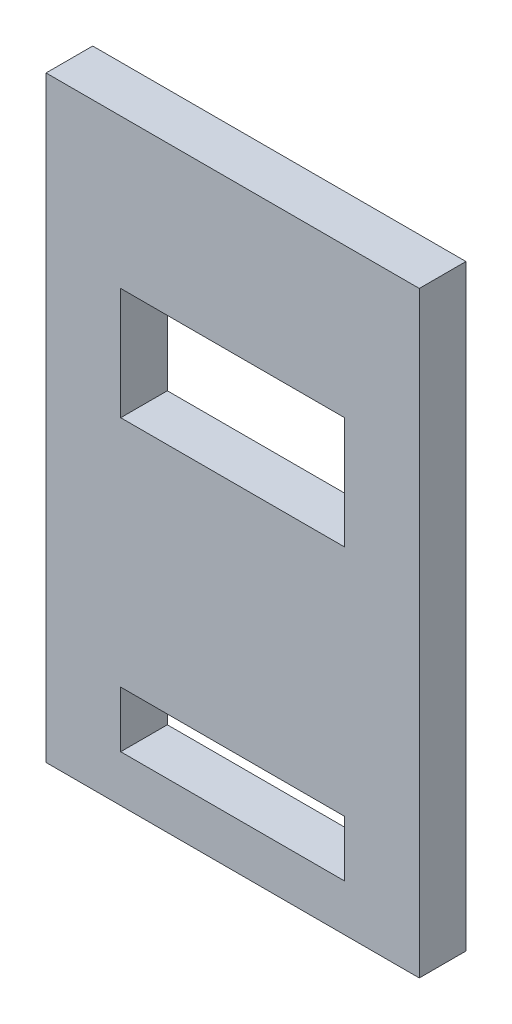
ISO-10303-21;
HEADER;
FILE_DESCRIPTION(('STEP AP214'),'2;1');
FILE_NAME('part.step','',(''),(''),'','','');
FILE_SCHEMA(('AUTOMOTIVE_DESIGN { 1 0 10303 214 1 1 1 1 }'));
ENDSEC;
DATA;
#1=APPLICATION_CONTEXT('core data for automotive mechanical design processes');
#2=APPLICATION_PROTOCOL_DEFINITION('international standard','automotive_design',2000,#1);
#3=PRODUCT_CONTEXT('',#1,'mechanical');
#4=PRODUCT('Part','Part','',(#3));
#5=PRODUCT_RELATED_PRODUCT_CATEGORY('part','',(#4));
#6=PRODUCT_DEFINITION_FORMATION('','',#4);
#7=PRODUCT_DEFINITION_CONTEXT('part definition',#1,'design');
#8=PRODUCT_DEFINITION('design','',#6,#7);
#9=PRODUCT_DEFINITION_SHAPE('','',#8);
#10=(LENGTH_UNIT() NAMED_UNIT(*) SI_UNIT(.MILLI.,.METRE.));
#11=(NAMED_UNIT(*) PLANE_ANGLE_UNIT() SI_UNIT($,.RADIAN.));
#12=(NAMED_UNIT(*) SI_UNIT($,.STERADIAN.) SOLID_ANGLE_UNIT());
#13=UNCERTAINTY_MEASURE_WITH_UNIT(LENGTH_MEASURE(1.E-05),#10,'distance_accuracy_value','');
#14=(GEOMETRIC_REPRESENTATION_CONTEXT(3) GLOBAL_UNCERTAINTY_ASSIGNED_CONTEXT((#13)) GLOBAL_UNIT_ASSIGNED_CONTEXT((#10,
#11,#12)) REPRESENTATION_CONTEXT('',''));
#15=CARTESIAN_POINT('',(0.,0.,0.));
#16=DIRECTION('',(0.,0.,1.));
#17=DIRECTION('',(1.,0.,0.));
#18=AXIS2_PLACEMENT_3D('',#15,#16,#17);
#19=CARTESIAN_POINT('',(-42.7885304659498,106.01541218638,15.875));
#20=DIRECTION('',(1.,0.,0.));
#21=DIRECTION('',(0.,1.,0.));
#22=AXIS2_PLACEMENT_3D('',#19,#20,#21);
#23=PLANE('',#22);
#24=DIRECTION('',(0.,-1.,0.));
#25=VECTOR('',#24,1.);
#26=CARTESIAN_POINT('',(-42.7885304659498,106.01541218638,0.));
#27=LINE('',#26,#25);
#28=CARTESIAN_POINT('',(-42.7885304659498,106.01541218638,0.));
#29=VERTEX_POINT('',#28);
#30=CARTESIAN_POINT('',(-42.7885304659498,-97.1845878136201,0.));
#31=VERTEX_POINT('',#30);
#32=EDGE_CURVE('E183',#29,#31,#27,.T.);
#33=ORIENTED_EDGE('',*,*,#32,.T.);
#34=DIRECTION('',(0.,0.,-1.));
#35=VECTOR('',#34,1.);
#36=CARTESIAN_POINT('',(-42.7885304659498,-97.1845878136201,15.875));
#37=LINE('',#36,#35);
#38=CARTESIAN_POINT('',(-42.7885304659498,-97.1845878136201,15.875));
#39=VERTEX_POINT('',#38);
#40=EDGE_CURVE('E11',#39,#31,#37,.T.);
#41=ORIENTED_EDGE('',*,*,#40,.F.);
#42=DIRECTION('',(0.,-1.,0.));
#43=VECTOR('',#42,1.);
#44=CARTESIAN_POINT('',(-42.7885304659498,106.01541218638,15.875));
#45=LINE('',#44,#43);
#46=CARTESIAN_POINT('',(-42.7885304659498,106.01541218638,15.875));
#47=VERTEX_POINT('',#46);
#48=EDGE_CURVE('E190',#47,#39,#45,.T.);
#49=ORIENTED_EDGE('',*,*,#48,.F.);
#50=DIRECTION('',(0.,0.,-1.));
#51=VECTOR('',#50,1.);
#52=CARTESIAN_POINT('',(-42.7885304659498,106.01541218638,15.875));
#53=LINE('',#52,#51);
#54=EDGE_CURVE('E200',#47,#29,#53,.T.);
#55=ORIENTED_EDGE('',*,*,#54,.T.);
#56=EDGE_LOOP('',(#33,#41,#49,#55));
#57=FACE_BOUND('',#56,.T.);
#58=ADVANCED_FACE('F33',(#57),#23,.F.);
#59=CARTESIAN_POINT('',(-42.7885304659498,-97.1845878136201,15.875));
#60=DIRECTION('',(0.,1.,0.));
#61=DIRECTION('',(0.,0.,1.));
#62=AXIS2_PLACEMENT_3D('',#59,#60,#61);
#63=PLANE('',#62);
#64=DIRECTION('',(1.,0.,0.));
#65=VECTOR('',#64,1.);
#66=CARTESIAN_POINT('',(-42.7885304659498,-97.1845878136201,0.));
#67=LINE('',#66,#65);
#68=CARTESIAN_POINT('',(84.2114695340502,-97.1845878136201,0.));
#69=VERTEX_POINT('',#68);
#70=EDGE_CURVE('E203',#31,#69,#67,.T.);
#71=ORIENTED_EDGE('',*,*,#70,.T.);
#72=DIRECTION('',(0.,0.,-1.));
#73=VECTOR('',#72,1.);
#74=CARTESIAN_POINT('',(84.2114695340502,-97.1845878136201,15.875));
#75=LINE('',#74,#73);
#76=CARTESIAN_POINT('',(84.2114695340502,-97.1845878136201,15.875));
#77=VERTEX_POINT('',#76);
#78=EDGE_CURVE('E40',#77,#69,#75,.T.);
#79=ORIENTED_EDGE('',*,*,#78,.F.);
#80=DIRECTION('',(1.,0.,0.));
#81=VECTOR('',#80,1.);
#82=CARTESIAN_POINT('',(-42.7885304659498,-97.1845878136201,15.875));
#83=LINE('',#82,#81);
#84=EDGE_CURVE('E193',#39,#77,#83,.T.);
#85=ORIENTED_EDGE('',*,*,#84,.F.);
#86=ORIENTED_EDGE('',*,*,#40,.T.);
#87=EDGE_LOOP('',(#71,#79,#85,#86));
#88=FACE_BOUND('',#87,.T.);
#89=ADVANCED_FACE('F232',(#88),#63,.F.);
#90=CARTESIAN_POINT('',(84.2114695340502,106.01541218638,15.875));
#91=DIRECTION('',(-1.,0.,0.));
#92=DIRECTION('',(0.,-1.,0.));
#93=AXIS2_PLACEMENT_3D('',#90,#91,#92);
#94=PLANE('',#93);
#95=DIRECTION('',(0.,1.,0.));
#96=VECTOR('',#95,1.);
#97=CARTESIAN_POINT('',(84.2114695340502,106.01541218638,0.));
#98=LINE('',#97,#96);
#99=CARTESIAN_POINT('',(84.2114695340502,106.01541218638,0.));
#100=VERTEX_POINT('',#99);
#101=EDGE_CURVE('E205',#69,#100,#98,.T.);
#102=ORIENTED_EDGE('',*,*,#101,.T.);
#103=DIRECTION('',(0.,0.,-1.));
#104=VECTOR('',#103,1.);
#105=CARTESIAN_POINT('',(84.2114695340502,106.01541218638,15.875));
#106=LINE('',#105,#104);
#107=CARTESIAN_POINT('',(84.2114695340502,106.01541218638,15.875));
#108=VERTEX_POINT('',#107);
#109=EDGE_CURVE('E210',#108,#100,#106,.T.);
#110=ORIENTED_EDGE('',*,*,#109,.F.);
#111=DIRECTION('',(0.,1.,0.));
#112=VECTOR('',#111,1.);
#113=CARTESIAN_POINT('',(84.2114695340502,106.01541218638,15.875));
#114=LINE('',#113,#112);
#115=EDGE_CURVE('E196',#77,#108,#114,.T.);
#116=ORIENTED_EDGE('',*,*,#115,.F.);
#117=ORIENTED_EDGE('',*,*,#78,.T.);
#118=EDGE_LOOP('',(#102,#110,#116,#117));
#119=FACE_BOUND('',#118,.T.);
#120=ADVANCED_FACE('F217',(#119),#94,.F.);
#121=CARTESIAN_POINT('',(-42.7885304659498,106.01541218638,15.875));
#122=DIRECTION('',(0.,-1.,0.));
#123=DIRECTION('',(0.,0.,-1.));
#124=AXIS2_PLACEMENT_3D('',#121,#122,#123);
#125=PLANE('',#124);
#126=DIRECTION('',(-1.,0.,0.));
#127=VECTOR('',#126,1.);
#128=CARTESIAN_POINT('',(-42.7885304659498,106.01541218638,0.));
#129=LINE('',#128,#127);
#130=EDGE_CURVE('E194',#100,#29,#129,.T.);
#131=ORIENTED_EDGE('',*,*,#130,.T.);
#132=ORIENTED_EDGE('',*,*,#54,.F.);
#133=DIRECTION('',(-1.,0.,0.));
#134=VECTOR('',#133,1.);
#135=CARTESIAN_POINT('',(-42.7885304659498,106.01541218638,15.875));
#136=LINE('',#135,#134);
#137=EDGE_CURVE('E198',#108,#47,#136,.T.);
#138=ORIENTED_EDGE('',*,*,#137,.F.);
#139=ORIENTED_EDGE('',*,*,#109,.T.);
#140=EDGE_LOOP('',(#131,#132,#138,#139));
#141=FACE_BOUND('',#140,.T.);
#142=ADVANCED_FACE('F225',(#141),#125,.F.);
#143=CARTESIAN_POINT('',(0.,0.,15.875));
#144=DIRECTION('',(0.,0.,1.));
#145=DIRECTION('',(1.,0.,0.));
#146=AXIS2_PLACEMENT_3D('',#143,#144,#145);
#147=PLANE('',#146);
#148=DIRECTION('',(0.,-1.,0.));
#149=VECTOR('',#148,1.);
#150=CARTESIAN_POINT('',(-17.3885304659498,-62.2595878136201,15.875));
#151=LINE('',#150,#149);
#152=CARTESIAN_POINT('',(-17.3885304659498,-62.2595878136201,15.875));
#153=VERTEX_POINT('',#152);
#154=CARTESIAN_POINT('',(-17.3885304659498,-81.3095878136201,15.875));
#155=VERTEX_POINT('',#154);
#156=EDGE_CURVE('E47',#153,#155,#151,.T.);
#157=ORIENTED_EDGE('',*,*,#156,.F.);
#158=DIRECTION('',(-1.,0.,0.));
#159=VECTOR('',#158,1.);
#160=CARTESIAN_POINT('',(-17.3885304659498,-62.2595878136201,15.875));
#161=LINE('',#160,#159);
#162=CARTESIAN_POINT('',(58.8114695340502,-62.2595878136201,15.875));
#163=VERTEX_POINT('',#162);
#164=EDGE_CURVE('E139',#163,#153,#161,.T.);
#165=ORIENTED_EDGE('',*,*,#164,.F.);
#166=DIRECTION('',(0.,1.,0.));
#167=VECTOR('',#166,1.);
#168=CARTESIAN_POINT('',(58.8114695340502,-62.2595878136201,15.875));
#169=LINE('',#168,#167);
#170=CARTESIAN_POINT('',(58.8114695340502,-81.3095878136201,15.875));
#171=VERTEX_POINT('',#170);
#172=EDGE_CURVE('E142',#171,#163,#169,.T.);
#173=ORIENTED_EDGE('',*,*,#172,.F.);
#174=DIRECTION('',(1.,0.,0.));
#175=VECTOR('',#174,1.);
#176=CARTESIAN_POINT('',(-17.3885304659498,-81.3095878136201,15.875));
#177=LINE('',#176,#175);
#178=EDGE_CURVE('E148',#155,#171,#177,.T.);
#179=ORIENTED_EDGE('',*,*,#178,.F.);
#180=EDGE_LOOP('',(#157,#165,#173,#179));
#181=FACE_BOUND('',#180,.T.);
#182=DIRECTION('',(0.,-1.,0.));
#183=VECTOR('',#182,1.);
#184=CARTESIAN_POINT('',(-17.3885304659498,55.2154121863799,15.875));
#185=LINE('',#184,#183);
#186=CARTESIAN_POINT('',(-17.3885304659498,55.2154121863799,15.875));
#187=VERTEX_POINT('',#186);
#188=CARTESIAN_POINT('',(-17.3885304659498,17.1154121863799,15.875));
#189=VERTEX_POINT('',#188);
#190=EDGE_CURVE('E154',#187,#189,#185,.T.);
#191=ORIENTED_EDGE('',*,*,#190,.F.);
#192=DIRECTION('',(-1.,0.,0.));
#193=VECTOR('',#192,1.);
#194=CARTESIAN_POINT('',(-17.3885304659498,55.2154121863799,15.875));
#195=LINE('',#194,#193);
#196=CARTESIAN_POINT('',(58.8114695340502,55.2154121863799,15.875));
#197=VERTEX_POINT('',#196);
#198=EDGE_CURVE('E162',#197,#187,#195,.T.);
#199=ORIENTED_EDGE('',*,*,#198,.F.);
#200=DIRECTION('',(0.,1.,0.));
#201=VECTOR('',#200,1.);
#202=CARTESIAN_POINT('',(58.8114695340502,55.2154121863799,15.875));
#203=LINE('',#202,#201);
#204=CARTESIAN_POINT('',(58.8114695340502,17.1154121863799,15.875));
#205=VERTEX_POINT('',#204);
#206=EDGE_CURVE('E176',#205,#197,#203,.T.);
#207=ORIENTED_EDGE('',*,*,#206,.F.);
#208=DIRECTION('',(1.,0.,0.));
#209=VECTOR('',#208,1.);
#210=CARTESIAN_POINT('',(-17.3885304659498,17.1154121863799,15.875));
#211=LINE('',#210,#209);
#212=EDGE_CURVE('E173',#189,#205,#211,.T.);
#213=ORIENTED_EDGE('',*,*,#212,.F.);
#214=EDGE_LOOP('',(#191,#199,#207,#213));
#215=FACE_BOUND('',#214,.T.);
#216=ORIENTED_EDGE('',*,*,#48,.T.);
#217=ORIENTED_EDGE('',*,*,#84,.T.);
#218=ORIENTED_EDGE('',*,*,#115,.T.);
#219=ORIENTED_EDGE('',*,*,#137,.T.);
#220=EDGE_LOOP('',(#216,#217,#218,#219));
#221=FACE_BOUND('',#220,.T.);
#222=ADVANCED_FACE('F231',(#181,#215,#221),#147,.T.);
#223=CARTESIAN_POINT('',(0.,0.,0.));
#224=DIRECTION('',(0.,0.,1.));
#225=DIRECTION('',(1.,0.,0.));
#226=AXIS2_PLACEMENT_3D('',#223,#224,#225);
#227=PLANE('',#226);
#228=DIRECTION('',(-1.,0.,0.));
#229=VECTOR('',#228,1.);
#230=CARTESIAN_POINT('',(-17.3885304659498,-62.2595878136201,0.));
#231=LINE('',#230,#229);
#232=CARTESIAN_POINT('',(58.8114695340502,-62.2595878136201,0.));
#233=VERTEX_POINT('',#232);
#234=CARTESIAN_POINT('',(-17.3885304659498,-62.2595878136201,0.));
#235=VERTEX_POINT('',#234);
#236=EDGE_CURVE('E129',#233,#235,#231,.T.);
#237=ORIENTED_EDGE('',*,*,#236,.T.);
#238=DIRECTION('',(0.,-1.,0.));
#239=VECTOR('',#238,1.);
#240=CARTESIAN_POINT('',(-17.3885304659498,-62.2595878136201,0.));
#241=LINE('',#240,#239);
#242=CARTESIAN_POINT('',(-17.3885304659498,-81.3095878136201,0.));
#243=VERTEX_POINT('',#242);
#244=EDGE_CURVE('E123',#235,#243,#241,.T.);
#245=ORIENTED_EDGE('',*,*,#244,.T.);
#246=DIRECTION('',(1.,0.,0.));
#247=VECTOR('',#246,1.);
#248=CARTESIAN_POINT('',(-17.3885304659498,-81.3095878136201,0.));
#249=LINE('',#248,#247);
#250=CARTESIAN_POINT('',(58.8114695340502,-81.3095878136201,0.));
#251=VERTEX_POINT('',#250);
#252=EDGE_CURVE('E132',#243,#251,#249,.T.);
#253=ORIENTED_EDGE('',*,*,#252,.T.);
#254=DIRECTION('',(0.,1.,0.));
#255=VECTOR('',#254,1.);
#256=CARTESIAN_POINT('',(58.8114695340502,-62.2595878136201,0.));
#257=LINE('',#256,#255);
#258=EDGE_CURVE('E55',#251,#233,#257,.T.);
#259=ORIENTED_EDGE('',*,*,#258,.T.);
#260=EDGE_LOOP('',(#237,#245,#253,#259));
#261=FACE_BOUND('',#260,.T.);
#262=DIRECTION('',(-1.,0.,0.));
#263=VECTOR('',#262,1.);
#264=CARTESIAN_POINT('',(-17.3885304659498,55.2154121863799,0.));
#265=LINE('',#264,#263);
#266=CARTESIAN_POINT('',(58.8114695340502,55.2154121863799,0.));
#267=VERTEX_POINT('',#266);
#268=CARTESIAN_POINT('',(-17.3885304659498,55.2154121863799,0.));
#269=VERTEX_POINT('',#268);
#270=EDGE_CURVE('E168',#267,#269,#265,.T.);
#271=ORIENTED_EDGE('',*,*,#270,.T.);
#272=DIRECTION('',(0.,-1.,0.));
#273=VECTOR('',#272,1.);
#274=CARTESIAN_POINT('',(-17.3885304659498,55.2154121863799,0.));
#275=LINE('',#274,#273);
#276=CARTESIAN_POINT('',(-17.3885304659498,17.1154121863799,0.));
#277=VERTEX_POINT('',#276);
#278=EDGE_CURVE('E158',#269,#277,#275,.T.);
#279=ORIENTED_EDGE('',*,*,#278,.T.);
#280=DIRECTION('',(1.,0.,0.));
#281=VECTOR('',#280,1.);
#282=CARTESIAN_POINT('',(-17.3885304659498,17.1154121863799,0.));
#283=LINE('',#282,#281);
#284=CARTESIAN_POINT('',(58.8114695340502,17.1154121863799,0.));
#285=VERTEX_POINT('',#284);
#286=EDGE_CURVE('E161',#277,#285,#283,.T.);
#287=ORIENTED_EDGE('',*,*,#286,.T.);
#288=DIRECTION('',(0.,1.,0.));
#289=VECTOR('',#288,1.);
#290=CARTESIAN_POINT('',(58.8114695340502,55.2154121863799,0.));
#291=LINE('',#290,#289);
#292=EDGE_CURVE('E165',#285,#267,#291,.T.);
#293=ORIENTED_EDGE('',*,*,#292,.T.);
#294=EDGE_LOOP('',(#271,#279,#287,#293));
#295=FACE_BOUND('',#294,.T.);
#296=ORIENTED_EDGE('',*,*,#32,.F.);
#297=ORIENTED_EDGE('',*,*,#130,.F.);
#298=ORIENTED_EDGE('',*,*,#101,.F.);
#299=ORIENTED_EDGE('',*,*,#70,.F.);
#300=EDGE_LOOP('',(#296,#297,#298,#299));
#301=FACE_BOUND('',#300,.T.);
#302=ADVANCED_FACE('F136',(#261,#295,#301),#227,.F.);
#303=CARTESIAN_POINT('',(-17.3885304659498,55.2154121863799,0.));
#304=DIRECTION('',(-1.,0.,0.));
#305=DIRECTION('',(0.,-1.,0.));
#306=AXIS2_PLACEMENT_3D('',#303,#304,#305);
#307=PLANE('',#306);
#308=ORIENTED_EDGE('',*,*,#190,.T.);
#309=DIRECTION('',(0.,0.,1.));
#310=VECTOR('',#309,1.);
#311=CARTESIAN_POINT('',(-17.3885304659498,17.1154121863799,0.));
#312=LINE('',#311,#310);
#313=EDGE_CURVE('E171',#277,#189,#312,.T.);
#314=ORIENTED_EDGE('',*,*,#313,.F.);
#315=ORIENTED_EDGE('',*,*,#278,.F.);
#316=DIRECTION('',(0.,0.,1.));
#317=VECTOR('',#316,1.);
#318=CARTESIAN_POINT('',(-17.3885304659498,55.2154121863799,0.));
#319=LINE('',#318,#317);
#320=EDGE_CURVE('E181',#269,#187,#319,.T.);
#321=ORIENTED_EDGE('',*,*,#320,.T.);
#322=EDGE_LOOP('',(#308,#314,#315,#321));
#323=FACE_BOUND('',#322,.T.);
#324=ADVANCED_FACE('F244',(#323),#307,.F.);
#325=CARTESIAN_POINT('',(-17.3885304659498,55.2154121863799,0.));
#326=DIRECTION('',(0.,1.,0.));
#327=DIRECTION('',(-1.,0.,0.));
#328=AXIS2_PLACEMENT_3D('',#325,#326,#327);
#329=PLANE('',#328);
#330=ORIENTED_EDGE('',*,*,#198,.T.);
#331=ORIENTED_EDGE('',*,*,#320,.F.);
#332=ORIENTED_EDGE('',*,*,#270,.F.);
#333=DIRECTION('',(0.,0.,1.));
#334=VECTOR('',#333,1.);
#335=CARTESIAN_POINT('',(58.8114695340502,55.2154121863799,0.));
#336=LINE('',#335,#334);
#337=EDGE_CURVE('E184',#267,#197,#336,.T.);
#338=ORIENTED_EDGE('',*,*,#337,.T.);
#339=EDGE_LOOP('',(#330,#331,#332,#338));
#340=FACE_BOUND('',#339,.T.);
#341=ADVANCED_FACE('F250',(#340),#329,.F.);
#342=CARTESIAN_POINT('',(58.8114695340502,55.2154121863799,0.));
#343=DIRECTION('',(1.,0.,0.));
#344=DIRECTION('',(0.,1.,0.));
#345=AXIS2_PLACEMENT_3D('',#342,#343,#344);
#346=PLANE('',#345);
#347=ORIENTED_EDGE('',*,*,#206,.T.);
#348=ORIENTED_EDGE('',*,*,#337,.F.);
#349=ORIENTED_EDGE('',*,*,#292,.F.);
#350=DIRECTION('',(0.,0.,1.));
#351=VECTOR('',#350,1.);
#352=CARTESIAN_POINT('',(58.8114695340502,17.1154121863799,0.));
#353=LINE('',#352,#351);
#354=EDGE_CURVE('E186',#285,#205,#353,.T.);
#355=ORIENTED_EDGE('',*,*,#354,.T.);
#356=EDGE_LOOP('',(#347,#348,#349,#355));
#357=FACE_BOUND('',#356,.T.);
#358=ADVANCED_FACE('F255',(#357),#346,.F.);
#359=CARTESIAN_POINT('',(-17.3885304659498,17.1154121863799,0.));
#360=DIRECTION('',(0.,-1.,0.));
#361=DIRECTION('',(1.,0.,0.));
#362=AXIS2_PLACEMENT_3D('',#359,#360,#361);
#363=PLANE('',#362);
#364=ORIENTED_EDGE('',*,*,#212,.T.);
#365=ORIENTED_EDGE('',*,*,#354,.F.);
#366=ORIENTED_EDGE('',*,*,#286,.F.);
#367=ORIENTED_EDGE('',*,*,#313,.T.);
#368=EDGE_LOOP('',(#364,#365,#366,#367));
#369=FACE_BOUND('',#368,.T.);
#370=ADVANCED_FACE('F252',(#369),#363,.F.);
#371=CARTESIAN_POINT('',(-17.3885304659498,-62.2595878136201,0.));
#372=DIRECTION('',(-1.,0.,0.));
#373=DIRECTION('',(0.,-1.,0.));
#374=AXIS2_PLACEMENT_3D('',#371,#372,#373);
#375=PLANE('',#374);
#376=ORIENTED_EDGE('',*,*,#156,.T.);
#377=DIRECTION('',(0.,0.,1.));
#378=VECTOR('',#377,1.);
#379=CARTESIAN_POINT('',(-17.3885304659498,-81.3095878136201,0.));
#380=LINE('',#379,#378);
#381=EDGE_CURVE('E119',#243,#155,#380,.T.);
#382=ORIENTED_EDGE('',*,*,#381,.F.);
#383=ORIENTED_EDGE('',*,*,#244,.F.);
#384=DIRECTION('',(0.,0.,1.));
#385=VECTOR('',#384,1.);
#386=CARTESIAN_POINT('',(-17.3885304659498,-62.2595878136201,0.));
#387=LINE('',#386,#385);
#388=EDGE_CURVE('E152',#235,#153,#387,.T.);
#389=ORIENTED_EDGE('',*,*,#388,.T.);
#390=EDGE_LOOP('',(#376,#382,#383,#389));
#391=FACE_BOUND('',#390,.T.);
#392=ADVANCED_FACE('F121',(#391),#375,.F.);
#393=CARTESIAN_POINT('',(-17.3885304659498,-62.2595878136201,0.));
#394=DIRECTION('',(0.,1.,0.));
#395=DIRECTION('',(-1.,0.,0.));
#396=AXIS2_PLACEMENT_3D('',#393,#394,#395);
#397=PLANE('',#396);
#398=ORIENTED_EDGE('',*,*,#164,.T.);
#399=ORIENTED_EDGE('',*,*,#388,.F.);
#400=ORIENTED_EDGE('',*,*,#236,.F.);
#401=DIRECTION('',(0.,0.,1.));
#402=VECTOR('',#401,1.);
#403=CARTESIAN_POINT('',(58.8114695340502,-62.2595878136201,0.));
#404=LINE('',#403,#402);
#405=EDGE_CURVE('E155',#233,#163,#404,.T.);
#406=ORIENTED_EDGE('',*,*,#405,.T.);
#407=EDGE_LOOP('',(#398,#399,#400,#406));
#408=FACE_BOUND('',#407,.T.);
#409=ADVANCED_FACE('F265',(#408),#397,.F.);
#410=CARTESIAN_POINT('',(58.8114695340502,-62.2595878136201,0.));
#411=DIRECTION('',(1.,0.,0.));
#412=DIRECTION('',(0.,1.,0.));
#413=AXIS2_PLACEMENT_3D('',#410,#411,#412);
#414=PLANE('',#413);
#415=ORIENTED_EDGE('',*,*,#172,.T.);
#416=ORIENTED_EDGE('',*,*,#405,.F.);
#417=ORIENTED_EDGE('',*,*,#258,.F.);
#418=DIRECTION('',(0.,0.,1.));
#419=VECTOR('',#418,1.);
#420=CARTESIAN_POINT('',(58.8114695340502,-81.3095878136201,0.));
#421=LINE('',#420,#419);
#422=EDGE_CURVE('E128',#251,#171,#421,.T.);
#423=ORIENTED_EDGE('',*,*,#422,.T.);
#424=EDGE_LOOP('',(#415,#416,#417,#423));
#425=FACE_BOUND('',#424,.T.);
#426=ADVANCED_FACE('F268',(#425),#414,.F.);
#427=CARTESIAN_POINT('',(-17.3885304659498,-81.3095878136201,0.));
#428=DIRECTION('',(0.,-1.,0.));
#429=DIRECTION('',(1.,0.,0.));
#430=AXIS2_PLACEMENT_3D('',#427,#428,#429);
#431=PLANE('',#430);
#432=ORIENTED_EDGE('',*,*,#178,.T.);
#433=ORIENTED_EDGE('',*,*,#422,.F.);
#434=ORIENTED_EDGE('',*,*,#252,.F.);
#435=ORIENTED_EDGE('',*,*,#381,.T.);
#436=EDGE_LOOP('',(#432,#433,#434,#435));
#437=FACE_BOUND('',#436,.T.);
#438=ADVANCED_FACE('F133',(#437),#431,.F.);
#439=CLOSED_SHELL('',(#58,#89,#120,#142,#222,#302,#324,#341,#358,#370,#392,#409,#426,#438));
#440=MANIFOLD_SOLID_BREP('B2',#439);
#441=ADVANCED_BREP_SHAPE_REPRESENTATION('',(#18,#440),#14);
#442=SHAPE_DEFINITION_REPRESENTATION(#9,#441);
ENDSEC;
END-ISO-10303-21;
